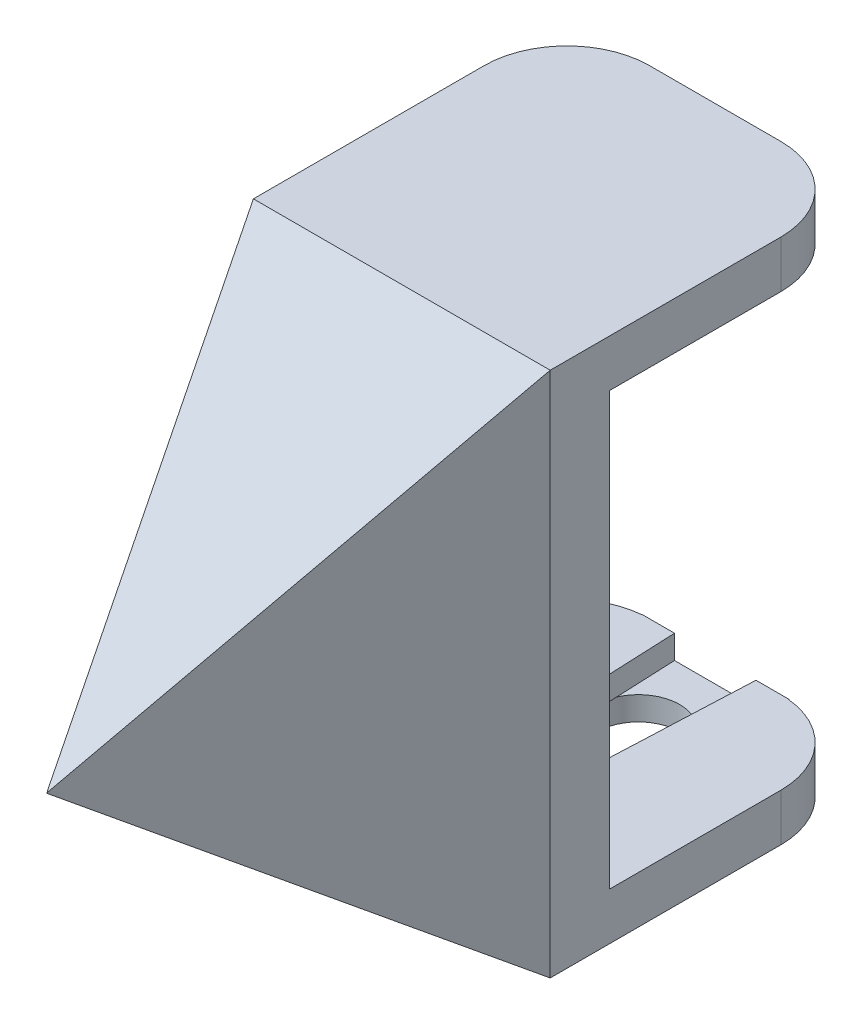
ISO-10303-21;
HEADER;
FILE_DESCRIPTION(('STEP AP214'),'2;1');
FILE_NAME('part.step','',(''),(''),'','','');
FILE_SCHEMA(('AUTOMOTIVE_DESIGN { 1 0 10303 214 1 1 1 1 }'));
ENDSEC;
DATA;
#1=APPLICATION_CONTEXT('core data for automotive mechanical design processes');
#2=APPLICATION_PROTOCOL_DEFINITION('international standard','automotive_design',2000,#1);
#3=PRODUCT_CONTEXT('',#1,'mechanical');
#4=PRODUCT('Part','Part','',(#3));
#5=PRODUCT_RELATED_PRODUCT_CATEGORY('part','',(#4));
#6=PRODUCT_DEFINITION_FORMATION('','',#4);
#7=PRODUCT_DEFINITION_CONTEXT('part definition',#1,'design');
#8=PRODUCT_DEFINITION('design','',#6,#7);
#9=PRODUCT_DEFINITION_SHAPE('','',#8);
#10=(LENGTH_UNIT() NAMED_UNIT(*) SI_UNIT(.MILLI.,.METRE.));
#11=(NAMED_UNIT(*) PLANE_ANGLE_UNIT() SI_UNIT($,.RADIAN.));
#12=(NAMED_UNIT(*) SI_UNIT($,.STERADIAN.) SOLID_ANGLE_UNIT());
#13=UNCERTAINTY_MEASURE_WITH_UNIT(LENGTH_MEASURE(1.E-05),#10,'distance_accuracy_value','');
#14=(GEOMETRIC_REPRESENTATION_CONTEXT(3) GLOBAL_UNCERTAINTY_ASSIGNED_CONTEXT((#13)) GLOBAL_UNIT_ASSIGNED_CONTEXT((#10,
#11,#12)) REPRESENTATION_CONTEXT('',''));
#15=CARTESIAN_POINT('',(0.,0.,0.));
#16=DIRECTION('',(0.,0.,1.));
#17=DIRECTION('',(1.,0.,0.));
#18=AXIS2_PLACEMENT_3D('',#15,#16,#17);
#19=CARTESIAN_POINT('',(64.3396378324059,18.25,-5.));
#20=DIRECTION('',(0.,0.,1.));
#21=DIRECTION('',(0.,-1.,0.));
#22=AXIS2_PLACEMENT_3D('',#19,#20,#21);
#23=PLANE('',#22);
#24=DIRECTION('',(0.,-1.,0.));
#25=VECTOR('',#24,1.);
#26=CARTESIAN_POINT('',(-2.5,3.56930453656055,-5.00000000000001));
#27=LINE('',#26,#25);
#28=CARTESIAN_POINT('',(-2.5,-18.25,-5.00000000000001));
#29=VERTEX_POINT('',#28);
#30=CARTESIAN_POINT('',(-2.5,-20.25,-5.));
#31=VERTEX_POINT('',#30);
#32=EDGE_CURVE('E255',#29,#31,#27,.T.);
#33=ORIENTED_EDGE('',*,*,#32,.F.);
#34=DIRECTION('',(-1.,0.,0.));
#35=VECTOR('',#34,1.);
#36=CARTESIAN_POINT('',(64.3396378324059,-18.25,-5.00000000000001));
#37=LINE('',#36,#35);
#38=CARTESIAN_POINT('',(-10.2911800707043,-18.25,-4.99999999999999));
#39=VERTEX_POINT('',#38);
#40=EDGE_CURVE('E57',#29,#39,#37,.T.);
#41=ORIENTED_EDGE('',*,*,#40,.T.);
#42=DIRECTION('',(0.491187513523803,0.871053859734462,0.));
#43=VECTOR('',#42,1.);
#44=CARTESIAN_POINT('',(23.3311906068374,41.3746747845644,-5.));
#45=LINE('',#44,#43);
#46=CARTESIAN_POINT('',(0.,0.,-5.));
#47=VERTEX_POINT('',#46);
#48=EDGE_CURVE('E307',#39,#47,#45,.T.);
#49=ORIENTED_EDGE('',*,*,#48,.T.);
#50=DIRECTION('',(-0.566525946334175,0.824043901822086,0.));
#51=VECTOR('',#50,1.);
#52=CARTESIAN_POINT('',(12.1300416994218,-17.6438289471741,-5.00000000000001));
#53=LINE('',#52,#51);
#54=CARTESIAN_POINT('',(-12.5467811820916,18.25,-5.));
#55=VERTEX_POINT('',#54);
#56=EDGE_CURVE('E314',#47,#55,#53,.T.);
#57=ORIENTED_EDGE('',*,*,#56,.T.);
#58=DIRECTION('',(-1.,0.,0.));
#59=VECTOR('',#58,1.);
#60=CARTESIAN_POINT('',(64.3396378324059,18.25,-5.));
#61=LINE('',#60,#59);
#62=CARTESIAN_POINT('',(12.5467811820916,18.25,-5.));
#63=VERTEX_POINT('',#62);
#64=EDGE_CURVE('E355',#63,#55,#61,.T.);
#65=ORIENTED_EDGE('',*,*,#64,.F.);
#66=DIRECTION('',(0.,1.,0.));
#67=VECTOR('',#66,1.);
#68=CARTESIAN_POINT('',(12.5467811820916,18.25,-5.));
#69=LINE('',#68,#67);
#70=CARTESIAN_POINT('',(12.5467811820916,-18.25,-5.00000000000001));
#71=VERTEX_POINT('',#70);
#72=EDGE_CURVE('E364',#71,#63,#69,.T.);
#73=ORIENTED_EDGE('',*,*,#72,.F.);
#74=CARTESIAN_POINT('',(2.5,-18.25,-5.00000000000001));
#75=VERTEX_POINT('',#74);
#76=EDGE_CURVE('E61',#71,#75,#37,.T.);
#77=ORIENTED_EDGE('',*,*,#76,.T.);
#78=DIRECTION('',(0.,-1.,0.));
#79=VECTOR('',#78,1.);
#80=CARTESIAN_POINT('',(2.5,3.56930453656055,-5.));
#81=LINE('',#80,#79);
#82=CARTESIAN_POINT('',(2.5,-20.25,-4.99999999999999));
#83=VERTEX_POINT('',#82);
#84=EDGE_CURVE('E270',#75,#83,#81,.T.);
#85=ORIENTED_EDGE('',*,*,#84,.T.);
#86=DIRECTION('',(1.,0.,0.));
#87=VECTOR('',#86,1.);
#88=CARTESIAN_POINT('',(6.21914646917428,-20.25,-5.));
#89=LINE('',#88,#87);
#90=EDGE_CURVE('E332',#31,#83,#89,.T.);
#91=ORIENTED_EDGE('',*,*,#90,.F.);
#92=EDGE_LOOP('',(#33,#41,#49,#57,#65,#73,#77,#85,#91));
#93=FACE_BOUND('',#92,.T.);
#94=ADVANCED_FACE('F41',(#93),#23,.F.);
#95=CARTESIAN_POINT('',(0.,-20.25,0.));
#96=DIRECTION('',(0.,1.,0.));
#97=DIRECTION('',(0.,0.,1.));
#98=AXIS2_PLACEMENT_3D('',#95,#96,#97);
#99=PLANE('',#98);
#100=CARTESIAN_POINT('',(0.,-20.25,-10.));
#101=DIRECTION('',(0.,1.,0.));
#102=DIRECTION('',(0.,0.,1.));
#103=AXIS2_PLACEMENT_3D('',#100,#101,#102);
#104=CIRCLE('',#103,0.750000000000002);
#105=CARTESIAN_POINT('',(0.,-20.25,-9.25000000000001));
#106=VERTEX_POINT('',#105);
#107=EDGE_CURVE('E624',#106,#106,#104,.F.);
#108=ORIENTED_EDGE('',*,*,#107,.T.);
#109=EDGE_LOOP('',(#108));
#110=FACE_BOUND('',#109,.T.);
#111=DIRECTION('',(-0.0438577587864707,0.,-0.999037785568808));
#112=VECTOR('',#111,1.);
#113=CARTESIAN_POINT('',(-3.1585,-20.25,-20.));
#114=LINE('',#113,#112);
#115=CARTESIAN_POINT('',(-3.08601135668406,-20.25,-18.3487780565845));
#116=VERTEX_POINT('',#115);
#117=EDGE_CURVE('E224',#31,#116,#114,.T.);
#118=ORIENTED_EDGE('',*,*,#117,.F.);
#119=ORIENTED_EDGE('',*,*,#90,.T.);
#120=DIRECTION('',(-0.0438577587864707,0.,0.999037785568808));
#121=VECTOR('',#120,1.);
#122=CARTESIAN_POINT('',(3.1585,-20.25,-20.));
#123=LINE('',#122,#121);
#124=CARTESIAN_POINT('',(3.08601135668406,-20.25,-18.3487780565845));
#125=VERTEX_POINT('',#124);
#126=EDGE_CURVE('E272',#125,#83,#123,.T.);
#127=ORIENTED_EDGE('',*,*,#126,.F.);
#128=CARTESIAN_POINT('',(0.,-20.25,-20.));
#129=DIRECTION('',(0.,1.,0.));
#130=DIRECTION('',(0.,0.,1.));
#131=AXIS2_PLACEMENT_3D('',#128,#129,#130);
#132=CIRCLE('',#131,3.5);
#133=EDGE_CURVE('E330',#116,#125,#132,.T.);
#134=ORIENTED_EDGE('',*,*,#133,.F.);
#135=EDGE_LOOP('',(#118,#119,#127,#134));
#136=FACE_BOUND('',#135,.T.);
#137=ADVANCED_FACE('F447',(#110,#136),#99,.T.);
#138=CARTESIAN_POINT('',(64.3396378324059,-22.25,-26.5));
#139=DIRECTION('',(0.,1.,0.));
#140=DIRECTION('',(0.,0.,1.));
#141=AXIS2_PLACEMENT_3D('',#138,#139,#140);
#142=PLANE('',#141);
#143=CARTESIAN_POINT('',(0.,-22.25,-10.));
#144=DIRECTION('',(0.,-1.,0.));
#145=DIRECTION('',(0.,0.,-1.));
#146=AXIS2_PLACEMENT_3D('',#143,#144,#145);
#147=CIRCLE('',#146,0.750000000000002);
#148=CARTESIAN_POINT('',(0.,-22.25,-10.75));
#149=VERTEX_POINT('',#148);
#150=EDGE_CURVE('E282',#149,#149,#147,.T.);
#151=ORIENTED_EDGE('',*,*,#150,.F.);
#152=EDGE_LOOP('',(#151));
#153=FACE_BOUND('',#152,.T.);
#154=CARTESIAN_POINT('',(0.,-22.25,-20.));
#155=DIRECTION('',(0.,1.,0.));
#156=DIRECTION('',(0.,0.,1.));
#157=AXIS2_PLACEMENT_3D('',#154,#155,#156);
#158=CIRCLE('',#157,3.5);
#159=CARTESIAN_POINT('',(0.,-22.25,-16.5));
#160=VERTEX_POINT('',#159);
#161=EDGE_CURVE('E328',#160,#160,#158,.T.);
#162=ORIENTED_EDGE('',*,*,#161,.T.);
#163=EDGE_LOOP('',(#162));
#164=FACE_BOUND('',#163,.T.);
#165=DIRECTION('',(1.,0.,0.));
#166=VECTOR('',#165,1.);
#167=CARTESIAN_POINT('',(-12.5467811820916,-22.25,0.));
#168=LINE('',#167,#166);
#169=CARTESIAN_POINT('',(-12.5467811820916,-22.25,0.));
#170=VERTEX_POINT('',#169);
#171=CARTESIAN_POINT('',(12.5467811820916,-22.25,0.));
#172=VERTEX_POINT('',#171);
#173=EDGE_CURVE('E318',#170,#172,#168,.T.);
#174=ORIENTED_EDGE('',*,*,#173,.F.);
#175=DIRECTION('',(0.,0.,-1.));
#176=VECTOR('',#175,1.);
#177=CARTESIAN_POINT('',(-12.5467811820916,-22.25,-26.5));
#178=LINE('',#177,#176);
#179=CARTESIAN_POINT('',(-12.5467811820916,-22.25,-19.5));
#180=VERTEX_POINT('',#179);
#181=EDGE_CURVE('E340',#170,#180,#178,.T.);
#182=ORIENTED_EDGE('',*,*,#181,.T.);
#183=CARTESIAN_POINT('',(-5.54678118209162,-22.25,-19.5));
#184=DIRECTION('',(0.,1.,0.));
#185=DIRECTION('',(0.,0.,1.));
#186=AXIS2_PLACEMENT_3D('',#183,#184,#185);
#187=CIRCLE('',#186,7.);
#188=CARTESIAN_POINT('',(-5.54678118209162,-22.25,-26.5));
#189=VERTEX_POINT('',#188);
#190=EDGE_CURVE('E398',#180,#189,#187,.F.);
#191=ORIENTED_EDGE('',*,*,#190,.T.);
#192=DIRECTION('',(-1.,0.,0.));
#193=VECTOR('',#192,1.);
#194=CARTESIAN_POINT('',(64.3396378324059,-22.25,-26.5));
#195=LINE('',#194,#193);
#196=CARTESIAN_POINT('',(5.54678118209161,-22.25,-26.5));
#197=VERTEX_POINT('',#196);
#198=EDGE_CURVE('E338',#197,#189,#195,.T.);
#199=ORIENTED_EDGE('',*,*,#198,.F.);
#200=CARTESIAN_POINT('',(5.54678118209161,-22.25,-19.5));
#201=DIRECTION('',(0.,1.,0.));
#202=DIRECTION('',(0.,0.,1.));
#203=AXIS2_PLACEMENT_3D('',#200,#201,#202);
#204=CIRCLE('',#203,7.);
#205=CARTESIAN_POINT('',(12.5467811820916,-22.25,-19.5));
#206=VERTEX_POINT('',#205);
#207=EDGE_CURVE('E395',#197,#206,#204,.F.);
#208=ORIENTED_EDGE('',*,*,#207,.T.);
#209=DIRECTION('',(0.,0.,-1.));
#210=VECTOR('',#209,1.);
#211=CARTESIAN_POINT('',(12.5467811820916,-22.25,-26.5));
#212=LINE('',#211,#210);
#213=EDGE_CURVE('E337',#172,#206,#212,.T.);
#214=ORIENTED_EDGE('',*,*,#213,.F.);
#215=EDGE_LOOP('',(#174,#182,#191,#199,#208,#214));
#216=FACE_BOUND('',#215,.T.);
#217=ADVANCED_FACE('F451',(#153,#164,#216),#142,.F.);
#218=CARTESIAN_POINT('',(-12.5467811820916,-53.9370800671778,23.55));
#219=DIRECTION('',(-1.,0.,0.));
#220=DIRECTION('',(0.,0.,1.));
#221=AXIS2_PLACEMENT_3D('',#218,#219,#220);
#222=PLANE('',#221);
#223=DIRECTION('',(0.,0.,-1.));
#224=VECTOR('',#223,1.);
#225=CARTESIAN_POINT('',(-12.5467811820916,18.25,30.));
#226=LINE('',#225,#224);
#227=CARTESIAN_POINT('',(-12.5467811820916,18.25,0.));
#228=VERTEX_POINT('',#227);
#229=EDGE_CURVE('E291',#228,#55,#226,.T.);
#230=ORIENTED_EDGE('',*,*,#229,.F.);
#231=DIRECTION('',(0.,-1.,0.));
#232=VECTOR('',#231,1.);
#233=CARTESIAN_POINT('',(-12.5467811820916,-22.25,0.));
#234=LINE('',#233,#232);
#235=CARTESIAN_POINT('',(-12.5467811820916,22.25,0.));
#236=VERTEX_POINT('',#235);
#237=EDGE_CURVE('E341',#236,#228,#234,.T.);
#238=ORIENTED_EDGE('',*,*,#237,.F.);
#239=DIRECTION('',(0.,0.,1.));
#240=VECTOR('',#239,1.);
#241=CARTESIAN_POINT('',(-12.5467811820916,22.25,0.));
#242=LINE('',#241,#240);
#243=CARTESIAN_POINT('',(-12.5467811820916,22.25,-19.5));
#244=VERTEX_POINT('',#243);
#245=EDGE_CURVE('E342',#244,#236,#242,.T.);
#246=ORIENTED_EDGE('',*,*,#245,.F.);
#247=DIRECTION('',(0.,1.,0.));
#248=VECTOR('',#247,1.);
#249=CARTESIAN_POINT('',(-12.5467811820916,18.25,-19.5));
#250=LINE('',#249,#248);
#251=CARTESIAN_POINT('',(-12.5467811820916,18.25,-19.5));
#252=VERTEX_POINT('',#251);
#253=EDGE_CURVE('E394',#244,#252,#250,.F.);
#254=ORIENTED_EDGE('',*,*,#253,.T.);
#255=DIRECTION('',(0.,0.,-1.));
#256=VECTOR('',#255,1.);
#257=CARTESIAN_POINT('',(-12.5467811820916,18.25,-26.5));
#258=LINE('',#257,#256);
#259=EDGE_CURVE('E348',#55,#252,#258,.T.);
#260=ORIENTED_EDGE('',*,*,#259,.F.);
#261=EDGE_LOOP('',(#230,#238,#246,#254,#260));
#262=FACE_BOUND('',#261,.T.);
#263=ADVANCED_FACE('F468',(#262),#222,.T.);
#264=CARTESIAN_POINT('',(64.3396378324059,-18.25,-5.00000000000001));
#265=DIRECTION('',(0.,-1.,0.));
#266=DIRECTION('',(0.,0.,-1.));
#267=AXIS2_PLACEMENT_3D('',#264,#265,#266);
#268=PLANE('',#267);
#269=CARTESIAN_POINT('',(-5.54678118209162,-18.25,-19.5));
#270=DIRECTION('',(0.,-1.,0.));
#271=DIRECTION('',(0.,0.,-1.));
#272=AXIS2_PLACEMENT_3D('',#269,#270,#271);
#273=CIRCLE('',#272,7.);
#274=CARTESIAN_POINT('',(-6.21914646917426,-18.25,-26.4676340977929));
#275=VERTEX_POINT('',#274);
#276=CARTESIAN_POINT('',(-10.2911800707044,-18.25,-24.6469096733603));
#277=VERTEX_POINT('',#276);
#278=EDGE_CURVE('E386',#275,#277,#273,.F.);
#279=ORIENTED_EDGE('',*,*,#278,.T.);
#280=DIRECTION('',(0.,0.,1.));
#281=VECTOR('',#280,1.);
#282=CARTESIAN_POINT('',(-10.2911800707043,-18.25,-5.00000000000001));
#283=LINE('',#282,#281);
#284=EDGE_CURVE('E305',#277,#39,#283,.T.);
#285=ORIENTED_EDGE('',*,*,#284,.T.);
#286=ORIENTED_EDGE('',*,*,#40,.F.);
#287=DIRECTION('',(0.0438577587864707,0.,0.999037785568808));
#288=VECTOR('',#287,1.);
#289=CARTESIAN_POINT('',(-3.1585,-18.25,-20.));
#290=LINE('',#289,#288);
#291=CARTESIAN_POINT('',(-3.44385,-18.25,-26.5));
#292=VERTEX_POINT('',#291);
#293=EDGE_CURVE('E260',#292,#29,#290,.T.);
#294=ORIENTED_EDGE('',*,*,#293,.F.);
#295=DIRECTION('',(1.,0.,0.));
#296=VECTOR('',#295,1.);
#297=CARTESIAN_POINT('',(-3.44385,-18.25,-26.5));
#298=LINE('',#297,#296);
#299=CARTESIAN_POINT('',(-6.21914646917426,-18.25,-26.5));
#300=VERTEX_POINT('',#299);
#301=EDGE_CURVE('E257',#300,#292,#298,.T.);
#302=ORIENTED_EDGE('',*,*,#301,.F.);
#303=DIRECTION('',(0.,0.,-1.));
#304=VECTOR('',#303,1.);
#305=CARTESIAN_POINT('',(-6.21914646917426,-18.25,-26.5));
#306=LINE('',#305,#304);
#307=EDGE_CURVE('E231',#275,#300,#306,.T.);
#308=ORIENTED_EDGE('',*,*,#307,.F.);
#309=EDGE_LOOP('',(#279,#285,#286,#294,#302,#308));
#310=FACE_BOUND('',#309,.T.);
#311=ADVANCED_FACE('F464',(#310),#268,.F.);
#312=DIRECTION('',(0.,0.,1.));
#313=VECTOR('',#312,1.);
#314=CARTESIAN_POINT('',(12.5467811820916,-18.25,-5.00000000000001));
#315=LINE('',#314,#313);
#316=CARTESIAN_POINT('',(12.5467811820916,-18.25,-19.5));
#317=VERTEX_POINT('',#316);
#318=EDGE_CURVE('E368',#317,#71,#315,.T.);
#319=ORIENTED_EDGE('',*,*,#318,.F.);
#320=CARTESIAN_POINT('',(5.54678118209161,-18.25,-19.5));
#321=DIRECTION('',(0.,-1.,0.));
#322=DIRECTION('',(0.,0.,-1.));
#323=AXIS2_PLACEMENT_3D('',#320,#321,#322);
#324=CIRCLE('',#323,7.);
#325=CARTESIAN_POINT('',(6.21914646917426,-18.25,-26.4676340977929));
#326=VERTEX_POINT('',#325);
#327=EDGE_CURVE('E405',#317,#326,#324,.F.);
#328=ORIENTED_EDGE('',*,*,#327,.T.);
#329=DIRECTION('',(0.,0.,1.));
#330=VECTOR('',#329,1.);
#331=CARTESIAN_POINT('',(6.21914646917428,-18.25,-5.));
#332=LINE('',#331,#330);
#333=CARTESIAN_POINT('',(6.21914646917428,-18.25,-26.5));
#334=VERTEX_POINT('',#333);
#335=EDGE_CURVE('E259',#334,#326,#332,.T.);
#336=ORIENTED_EDGE('',*,*,#335,.F.);
#337=DIRECTION('',(1.,0.,0.));
#338=VECTOR('',#337,1.);
#339=CARTESIAN_POINT('',(3.44385,-18.25,-26.5));
#340=LINE('',#339,#338);
#341=CARTESIAN_POINT('',(3.44385,-18.25,-26.5));
#342=VERTEX_POINT('',#341);
#343=EDGE_CURVE('E277',#342,#334,#340,.T.);
#344=ORIENTED_EDGE('',*,*,#343,.F.);
#345=DIRECTION('',(0.0438577587864707,0.,-0.999037785568808));
#346=VECTOR('',#345,1.);
#347=CARTESIAN_POINT('',(3.1585,-18.25,-20.));
#348=LINE('',#347,#346);
#349=EDGE_CURVE('E264',#75,#342,#348,.T.);
#350=ORIENTED_EDGE('',*,*,#349,.F.);
#351=ORIENTED_EDGE('',*,*,#76,.F.);
#352=EDGE_LOOP('',(#319,#328,#336,#344,#350,#351));
#353=FACE_BOUND('',#352,.T.);
#354=ADVANCED_FACE('F463',(#353),#268,.F.);
#355=CARTESIAN_POINT('',(12.5467811820916,-53.9370800671778,23.55));
#356=DIRECTION('',(1.,0.,0.));
#357=DIRECTION('',(0.,0.,-1.));
#358=AXIS2_PLACEMENT_3D('',#355,#356,#357);
#359=PLANE('',#358);
#360=DIRECTION('',(0.,-1.,0.));
#361=VECTOR('',#360,1.);
#362=CARTESIAN_POINT('',(12.5467811820916,-22.25,0.));
#363=LINE('',#362,#361);
#364=CARTESIAN_POINT('',(12.5467811820916,22.25,0.));
#365=VERTEX_POINT('',#364);
#366=EDGE_CURVE('E352',#365,#172,#363,.T.);
#367=ORIENTED_EDGE('',*,*,#366,.T.);
#368=ORIENTED_EDGE('',*,*,#213,.T.);
#369=DIRECTION('',(0.,1.,0.));
#370=VECTOR('',#369,1.);
#371=CARTESIAN_POINT('',(12.5467811820916,-18.25,-19.5));
#372=LINE('',#371,#370);
#373=EDGE_CURVE('E403',#206,#317,#372,.T.);
#374=ORIENTED_EDGE('',*,*,#373,.T.);
#375=ORIENTED_EDGE('',*,*,#318,.T.);
#376=ORIENTED_EDGE('',*,*,#72,.T.);
#377=DIRECTION('',(0.,0.,-1.));
#378=VECTOR('',#377,1.);
#379=CARTESIAN_POINT('',(12.5467811820916,18.25,-26.5));
#380=LINE('',#379,#378);
#381=CARTESIAN_POINT('',(12.5467811820916,18.25,-19.5));
#382=VERTEX_POINT('',#381);
#383=EDGE_CURVE('E358',#63,#382,#380,.T.);
#384=ORIENTED_EDGE('',*,*,#383,.T.);
#385=DIRECTION('',(0.,1.,0.));
#386=VECTOR('',#385,1.);
#387=CARTESIAN_POINT('',(12.5467811820916,22.25,-19.5));
#388=LINE('',#387,#386);
#389=CARTESIAN_POINT('',(12.5467811820916,22.25,-19.5));
#390=VERTEX_POINT('',#389);
#391=EDGE_CURVE('E396',#382,#390,#388,.T.);
#392=ORIENTED_EDGE('',*,*,#391,.T.);
#393=DIRECTION('',(0.,0.,1.));
#394=VECTOR('',#393,1.);
#395=CARTESIAN_POINT('',(12.5467811820916,22.25,0.));
#396=LINE('',#395,#394);
#397=EDGE_CURVE('E360',#390,#365,#396,.T.);
#398=ORIENTED_EDGE('',*,*,#397,.T.);
#399=EDGE_LOOP('',(#367,#368,#374,#375,#376,#384,#392,#398));
#400=FACE_BOUND('',#399,.T.);
#401=ADVANCED_FACE('F470',(#400),#359,.T.);
#402=CARTESIAN_POINT('',(64.3396378324059,-18.25,-26.5));
#403=DIRECTION('',(0.,0.,1.));
#404=DIRECTION('',(0.,-1.,0.));
#405=AXIS2_PLACEMENT_3D('',#402,#403,#404);
#406=PLANE('',#405);
#407=ORIENTED_EDGE('',*,*,#198,.T.);
#408=DIRECTION('',(0.,1.,0.));
#409=VECTOR('',#408,1.);
#410=CARTESIAN_POINT('',(-5.54678118209162,-18.25,-26.5));
#411=LINE('',#410,#409);
#412=CARTESIAN_POINT('',(-5.54678118209162,-20.25,-26.5));
#413=VERTEX_POINT('',#412);
#414=EDGE_CURVE('E223',#189,#413,#411,.T.);
#415=ORIENTED_EDGE('',*,*,#414,.T.);
#416=DIRECTION('',(-1.,0.,0.));
#417=VECTOR('',#416,1.);
#418=CARTESIAN_POINT('',(-3.44385,-20.25,-26.5));
#419=LINE('',#418,#417);
#420=CARTESIAN_POINT('',(-6.21914646917426,-20.25,-26.5));
#421=VERTEX_POINT('',#420);
#422=EDGE_CURVE('E211',#413,#421,#419,.T.);
#423=ORIENTED_EDGE('',*,*,#422,.T.);
#424=DIRECTION('',(0.,-1.,0.));
#425=VECTOR('',#424,1.);
#426=CARTESIAN_POINT('',(-6.21914646917426,3.56930453656056,-26.5));
#427=LINE('',#426,#425);
#428=EDGE_CURVE('E220',#300,#421,#427,.T.);
#429=ORIENTED_EDGE('',*,*,#428,.F.);
#430=ORIENTED_EDGE('',*,*,#301,.T.);
#431=DIRECTION('',(0.,-1.,0.));
#432=VECTOR('',#431,1.);
#433=CARTESIAN_POINT('',(-3.44385,3.56930453656056,-26.5));
#434=LINE('',#433,#432);
#435=CARTESIAN_POINT('',(-3.44385,-20.25,-26.5));
#436=VERTEX_POINT('',#435);
#437=EDGE_CURVE('E233',#292,#436,#434,.T.);
#438=ORIENTED_EDGE('',*,*,#437,.T.);
#439=DIRECTION('',(-1.,0.,0.));
#440=VECTOR('',#439,1.);
#441=CARTESIAN_POINT('',(6.21914646917426,-20.25,-26.5));
#442=LINE('',#441,#440);
#443=CARTESIAN_POINT('',(3.44385,-20.25,-26.5));
#444=VERTEX_POINT('',#443);
#445=EDGE_CURVE('E326',#444,#436,#442,.T.);
#446=ORIENTED_EDGE('',*,*,#445,.F.);
#447=DIRECTION('',(0.,-1.,0.));
#448=VECTOR('',#447,1.);
#449=CARTESIAN_POINT('',(3.44385,3.56930453656056,-26.5));
#450=LINE('',#449,#448);
#451=EDGE_CURVE('E261',#342,#444,#450,.T.);
#452=ORIENTED_EDGE('',*,*,#451,.F.);
#453=ORIENTED_EDGE('',*,*,#343,.T.);
#454=DIRECTION('',(0.,-1.,0.));
#455=VECTOR('',#454,1.);
#456=CARTESIAN_POINT('',(6.21914646917428,3.56930453656056,-26.5));
#457=LINE('',#456,#455);
#458=CARTESIAN_POINT('',(6.21914646917428,-20.25,-26.5));
#459=VERTEX_POINT('',#458);
#460=EDGE_CURVE('E267',#334,#459,#457,.T.);
#461=ORIENTED_EDGE('',*,*,#460,.T.);
#462=DIRECTION('',(-1.,0.,0.));
#463=VECTOR('',#462,1.);
#464=CARTESIAN_POINT('',(3.44385,-20.25,-26.5));
#465=LINE('',#464,#463);
#466=CARTESIAN_POINT('',(5.54678118209161,-20.25,-26.5));
#467=VERTEX_POINT('',#466);
#468=EDGE_CURVE('E238',#459,#467,#465,.T.);
#469=ORIENTED_EDGE('',*,*,#468,.T.);
#470=DIRECTION('',(0.,1.,0.));
#471=VECTOR('',#470,1.);
#472=CARTESIAN_POINT('',(5.54678118209161,-22.25,-26.5));
#473=LINE('',#472,#471);
#474=EDGE_CURVE('E357',#467,#197,#473,.F.);
#475=ORIENTED_EDGE('',*,*,#474,.T.);
#476=EDGE_LOOP('',(#407,#415,#423,#429,#430,#438,#446,#452,#453,#461,#469,#475));
#477=FACE_BOUND('',#476,.T.);
#478=ADVANCED_FACE('F219',(#477),#406,.F.);
#479=CARTESIAN_POINT('',(64.3396378324059,18.25,-26.5));
#480=DIRECTION('',(0.,1.,0.));
#481=DIRECTION('',(0.,0.,1.));
#482=AXIS2_PLACEMENT_3D('',#479,#480,#481);
#483=PLANE('',#482);
#484=DIRECTION('',(-1.,0.,0.));
#485=VECTOR('',#484,1.);
#486=CARTESIAN_POINT('',(64.3396378324059,18.25,-26.5));
#487=LINE('',#486,#485);
#488=CARTESIAN_POINT('',(0.,18.25,-26.5));
#489=VERTEX_POINT('',#488);
#490=CARTESIAN_POINT('',(-5.54678118209162,18.25,-26.5));
#491=VERTEX_POINT('',#490);
#492=EDGE_CURVE('E351',#489,#491,#487,.T.);
#493=ORIENTED_EDGE('',*,*,#492,.F.);
#494=CARTESIAN_POINT('',(0.,18.25,-20.));
#495=DIRECTION('',(0.,1.,0.));
#496=DIRECTION('',(0.,0.,1.));
#497=AXIS2_PLACEMENT_3D('',#494,#495,#496);
#498=CIRCLE('',#497,6.5);
#499=EDGE_CURVE('E293',#489,#489,#498,.T.);
#500=ORIENTED_EDGE('',*,*,#499,.T.);
#501=CARTESIAN_POINT('',(5.54678118209161,18.25,-26.5));
#502=VERTEX_POINT('',#501);
#503=EDGE_CURVE('E371',#502,#489,#487,.T.);
#504=ORIENTED_EDGE('',*,*,#503,.F.);
#505=CARTESIAN_POINT('',(5.54678118209161,18.25,-19.5));
#506=DIRECTION('',(0.,1.,0.));
#507=DIRECTION('',(0.,0.,1.));
#508=AXIS2_PLACEMENT_3D('',#505,#506,#507);
#509=CIRCLE('',#508,7.);
#510=EDGE_CURVE('E418',#502,#382,#509,.F.);
#511=ORIENTED_EDGE('',*,*,#510,.T.);
#512=ORIENTED_EDGE('',*,*,#383,.F.);
#513=ORIENTED_EDGE('',*,*,#64,.T.);
#514=ORIENTED_EDGE('',*,*,#259,.T.);
#515=CARTESIAN_POINT('',(-5.54678118209162,18.25,-19.5));
#516=DIRECTION('',(0.,1.,0.));
#517=DIRECTION('',(0.,0.,1.));
#518=AXIS2_PLACEMENT_3D('',#515,#516,#517);
#519=CIRCLE('',#518,7.);
#520=EDGE_CURVE('E419',#252,#491,#519,.F.);
#521=ORIENTED_EDGE('',*,*,#520,.T.);
#522=EDGE_LOOP('',(#493,#500,#504,#511,#512,#513,#514,#521));
#523=FACE_BOUND('',#522,.T.);
#524=ADVANCED_FACE('F462',(#523),#483,.F.);
#525=CARTESIAN_POINT('',(64.3396378324059,22.25,-26.5));
#526=DIRECTION('',(0.,0.,1.));
#527=DIRECTION('',(0.,-1.,0.));
#528=AXIS2_PLACEMENT_3D('',#525,#526,#527);
#529=PLANE('',#528);
#530=ORIENTED_EDGE('',*,*,#503,.T.);
#531=ORIENTED_EDGE('',*,*,#492,.T.);
#532=DIRECTION('',(0.,1.,0.));
#533=VECTOR('',#532,1.);
#534=CARTESIAN_POINT('',(-5.54678118209162,22.25,-26.5));
#535=LINE('',#534,#533);
#536=CARTESIAN_POINT('',(-5.54678118209162,22.25,-26.5));
#537=VERTEX_POINT('',#536);
#538=EDGE_CURVE('E413',#491,#537,#535,.T.);
#539=ORIENTED_EDGE('',*,*,#538,.T.);
#540=DIRECTION('',(-1.,0.,0.));
#541=VECTOR('',#540,1.);
#542=CARTESIAN_POINT('',(64.3396378324059,22.25,-26.5));
#543=LINE('',#542,#541);
#544=CARTESIAN_POINT('',(5.54678118209161,22.25,-26.5));
#545=VERTEX_POINT('',#544);
#546=EDGE_CURVE('E350',#545,#537,#543,.T.);
#547=ORIENTED_EDGE('',*,*,#546,.F.);
#548=DIRECTION('',(0.,1.,0.));
#549=VECTOR('',#548,1.);
#550=CARTESIAN_POINT('',(5.54678118209161,18.25,-26.5));
#551=LINE('',#550,#549);
#552=EDGE_CURVE('E410',#545,#502,#551,.F.);
#553=ORIENTED_EDGE('',*,*,#552,.T.);
#554=EDGE_LOOP('',(#530,#531,#539,#547,#553));
#555=FACE_BOUND('',#554,.T.);
#556=ADVANCED_FACE('F579',(#555),#529,.F.);
#557=CARTESIAN_POINT('',(64.3396378324059,22.25,0.));
#558=DIRECTION('',(0.,-1.,0.));
#559=DIRECTION('',(0.,0.,-1.));
#560=AXIS2_PLACEMENT_3D('',#557,#558,#559);
#561=PLANE('',#560);
#562=ORIENTED_EDGE('',*,*,#546,.T.);
#563=CARTESIAN_POINT('',(-5.54678118209162,22.25,-19.5));
#564=DIRECTION('',(0.,-1.,0.));
#565=DIRECTION('',(0.,0.,-1.));
#566=AXIS2_PLACEMENT_3D('',#563,#564,#565);
#567=CIRCLE('',#566,7.);
#568=EDGE_CURVE('E416',#537,#244,#567,.F.);
#569=ORIENTED_EDGE('',*,*,#568,.T.);
#570=ORIENTED_EDGE('',*,*,#245,.T.);
#571=DIRECTION('',(1.,0.,0.));
#572=VECTOR('',#571,1.);
#573=CARTESIAN_POINT('',(-12.5467811820916,22.25,0.));
#574=LINE('',#573,#572);
#575=EDGE_CURVE('E317',#236,#365,#574,.T.);
#576=ORIENTED_EDGE('',*,*,#575,.T.);
#577=ORIENTED_EDGE('',*,*,#397,.F.);
#578=CARTESIAN_POINT('',(5.54678118209161,22.25,-19.5));
#579=DIRECTION('',(0.,-1.,0.));
#580=DIRECTION('',(0.,0.,-1.));
#581=AXIS2_PLACEMENT_3D('',#578,#579,#580);
#582=CIRCLE('',#581,7.);
#583=EDGE_CURVE('E414',#390,#545,#582,.F.);
#584=ORIENTED_EDGE('',*,*,#583,.T.);
#585=EDGE_LOOP('',(#562,#569,#570,#576,#577,#584));
#586=FACE_BOUND('',#585,.T.);
#587=ADVANCED_FACE('F544',(#586),#561,.F.);
#588=CARTESIAN_POINT('',(-3.21883787482848,-20.25,-21.3744390621522));
#589=VERTEX_POINT('',#588);
#590=EDGE_CURVE('E236',#589,#436,#114,.T.);
#591=ORIENTED_EDGE('',*,*,#590,.F.);
#592=CARTESIAN_POINT('',(3.21883787482848,-20.25,-21.3744390621521));
#593=VERTEX_POINT('',#592);
#594=EDGE_CURVE('E376',#593,#589,#132,.T.);
#595=ORIENTED_EDGE('',*,*,#594,.F.);
#596=EDGE_CURVE('E248',#444,#593,#123,.T.);
#597=ORIENTED_EDGE('',*,*,#596,.F.);
#598=ORIENTED_EDGE('',*,*,#445,.T.);
#599=EDGE_LOOP('',(#591,#595,#597,#598));
#600=FACE_BOUND('',#599,.T.);
#601=ADVANCED_FACE('F456',(#600),#99,.T.);
#602=CARTESIAN_POINT('',(0.,-22.25,-20.));
#603=DIRECTION('',(0.,1.,0.));
#604=DIRECTION('',(0.,0.,1.));
#605=AXIS2_PLACEMENT_3D('',#602,#603,#604);
#606=CYLINDRICAL_SURFACE('',#605,3.5);
#607=EDGE_CURVE('E331',#125,#593,#132,.T.);
#608=ORIENTED_EDGE('',*,*,#607,.T.);
#609=ORIENTED_EDGE('',*,*,#594,.T.);
#610=EDGE_CURVE('E294',#589,#116,#132,.T.);
#611=ORIENTED_EDGE('',*,*,#610,.T.);
#612=ORIENTED_EDGE('',*,*,#133,.T.);
#613=EDGE_LOOP('',(#608,#609,#611,#612));
#614=FACE_BOUND('',#613,.T.);
#615=ORIENTED_EDGE('',*,*,#161,.F.);
#616=EDGE_LOOP('',(#615));
#617=FACE_BOUND('',#616,.T.);
#618=ADVANCED_FACE('F476',(#614,#617),#606,.F.);
#619=CARTESIAN_POINT('',(-5.54678118209162,-18.25,-19.5));
#620=DIRECTION('',(0.,-1.,0.));
#621=DIRECTION('',(0.,0.,-1.));
#622=AXIS2_PLACEMENT_3D('',#619,#620,#621);
#623=CYLINDRICAL_SURFACE('',#622,7.);
#624=CARTESIAN_POINT('',(-5.54678118209162,-9.83645761493742,-19.5));
#625=DIRECTION('',(0.871053859734462,-0.491187513523803,0.));
#626=DIRECTION('',(-0.491187513523803,-0.871053859734462,0.));
#627=AXIS2_PLACEMENT_3D('',#624,#625,#626);
#628=ELLIPSE('',#627,14.2511766021527,7.);
#629=EDGE_CURVE('E304',#277,#180,#628,.F.);
#630=ORIENTED_EDGE('',*,*,#629,.F.);
#631=ORIENTED_EDGE('',*,*,#278,.F.);
#632=DIRECTION('',(0.,-1.,0.));
#633=VECTOR('',#632,1.);
#634=CARTESIAN_POINT('',(-6.21914646917427,-20.25,-26.4676340977929));
#635=LINE('',#634,#633);
#636=CARTESIAN_POINT('',(-6.21914646917427,-20.25,-26.4676340977929));
#637=VERTEX_POINT('',#636);
#638=EDGE_CURVE('E390',#637,#275,#635,.F.);
#639=ORIENTED_EDGE('',*,*,#638,.F.);
#640=CARTESIAN_POINT('',(-5.54678118209162,-20.25,-19.5));
#641=DIRECTION('',(0.,1.,0.));
#642=DIRECTION('',(0.,0.,1.));
#643=AXIS2_PLACEMENT_3D('',#640,#641,#642);
#644=CIRCLE('',#643,7.);
#645=EDGE_CURVE('E239',#413,#637,#644,.T.);
#646=ORIENTED_EDGE('',*,*,#645,.F.);
#647=ORIENTED_EDGE('',*,*,#414,.F.);
#648=ORIENTED_EDGE('',*,*,#190,.F.);
#649=EDGE_LOOP('',(#630,#631,#639,#646,#647,#648));
#650=FACE_BOUND('',#649,.T.);
#651=ADVANCED_FACE('F478',(#650),#623,.T.);
#652=CARTESIAN_POINT('',(5.54678118209161,-53.9370800671779,-19.4999999999999));
#653=DIRECTION('',(0.,-1.,0.));
#654=DIRECTION('',(0.,0.,-1.));
#655=AXIS2_PLACEMENT_3D('',#652,#653,#654);
#656=CYLINDRICAL_SURFACE('',#655,7.);
#657=ORIENTED_EDGE('',*,*,#207,.F.);
#658=ORIENTED_EDGE('',*,*,#474,.F.);
#659=CARTESIAN_POINT('',(5.54678118209161,-20.25,-19.5));
#660=DIRECTION('',(0.,1.,0.));
#661=DIRECTION('',(0.,0.,1.));
#662=AXIS2_PLACEMENT_3D('',#659,#660,#661);
#663=CIRCLE('',#662,7.);
#664=CARTESIAN_POINT('',(6.21914646917428,-20.25,-26.4676340977929));
#665=VERTEX_POINT('',#664);
#666=EDGE_CURVE('E381',#665,#467,#663,.T.);
#667=ORIENTED_EDGE('',*,*,#666,.F.);
#668=DIRECTION('',(0.,-1.,0.));
#669=VECTOR('',#668,1.);
#670=CARTESIAN_POINT('',(6.21914646917426,-18.25,-26.4676340977929));
#671=LINE('',#670,#669);
#672=EDGE_CURVE('E408',#326,#665,#671,.T.);
#673=ORIENTED_EDGE('',*,*,#672,.F.);
#674=ORIENTED_EDGE('',*,*,#327,.F.);
#675=ORIENTED_EDGE('',*,*,#373,.F.);
#676=EDGE_LOOP('',(#657,#658,#667,#673,#674,#675));
#677=FACE_BOUND('',#676,.T.);
#678=ADVANCED_FACE('F480',(#677),#656,.T.);
#679=CARTESIAN_POINT('',(-5.54678118209162,22.25,-19.5));
#680=DIRECTION('',(0.,-1.,0.));
#681=DIRECTION('',(0.,0.,-1.));
#682=AXIS2_PLACEMENT_3D('',#679,#680,#681);
#683=CYLINDRICAL_SURFACE('',#682,7.);
#684=ORIENTED_EDGE('',*,*,#520,.F.);
#685=ORIENTED_EDGE('',*,*,#253,.F.);
#686=ORIENTED_EDGE('',*,*,#568,.F.);
#687=ORIENTED_EDGE('',*,*,#538,.F.);
#688=EDGE_LOOP('',(#684,#685,#686,#687));
#689=FACE_BOUND('',#688,.T.);
#690=ADVANCED_FACE('F485',(#689),#683,.T.);
#691=CARTESIAN_POINT('',(5.54678118209161,-53.9370800671778,-19.5000000000001));
#692=DIRECTION('',(0.,-1.,0.));
#693=DIRECTION('',(0.,0.,-1.));
#694=AXIS2_PLACEMENT_3D('',#691,#692,#693);
#695=CYLINDRICAL_SURFACE('',#694,7.);
#696=ORIENTED_EDGE('',*,*,#510,.F.);
#697=ORIENTED_EDGE('',*,*,#552,.F.);
#698=ORIENTED_EDGE('',*,*,#583,.F.);
#699=ORIENTED_EDGE('',*,*,#391,.F.);
#700=EDGE_LOOP('',(#696,#697,#698,#699));
#701=FACE_BOUND('',#700,.T.);
#702=ADVANCED_FACE('F490',(#701),#695,.T.);
#703=CARTESIAN_POINT('',(12.5467811820916,-22.25,0.));
#704=DIRECTION('',(0.922286989349462,0.,0.386505768749582));
#705=DIRECTION('',(0.386505768749582,0.,-0.922286989349462));
#706=AXIS2_PLACEMENT_3D('',#703,#704,#705);
#707=PLANE('',#706);
#708=DIRECTION('',(0.31880693849891,0.565360491958324,-0.760742827831846));
#709=VECTOR('',#708,1.);
#710=CARTESIAN_POINT('',(4.52606346436015,8.02635437890257,19.1391803031567));
#711=LINE('',#710,#709);
#712=CARTESIAN_POINT('',(-0.0155148263884791,-0.0275134221386058,29.9763757794893));
#713=VERTEX_POINT('',#712);
#714=CARTESIAN_POINT('',(0.,0.,29.9393540228247));
#715=VERTEX_POINT('',#714);
#716=EDGE_CURVE('E297',#713,#715,#711,.T.);
#717=ORIENTED_EDGE('',*,*,#716,.F.);
#718=DIRECTION('',(-0.319058627321675,0.564409249584676,0.761343412209544));
#719=VECTOR('',#718,1.);
#720=CARTESIAN_POINT('',(12.5467811820916,-22.25,0.));
#721=LINE('',#720,#719);
#722=EDGE_CURVE('E321',#172,#713,#721,.T.);
#723=ORIENTED_EDGE('',*,*,#722,.F.);
#724=ORIENTED_EDGE('',*,*,#366,.F.);
#725=DIRECTION('',(0.319058627321675,0.564409249584676,-0.761343412209544));
#726=VECTOR('',#725,1.);
#727=CARTESIAN_POINT('',(4.53323718339523,8.07417785475522,19.1220622462834));
#728=LINE('',#727,#726);
#729=CARTESIAN_POINT('',(-0.0170492371306162,0.0247990758042351,29.98003721789));
#730=VERTEX_POINT('',#729);
#731=EDGE_CURVE('E323',#730,#365,#728,.T.);
#732=ORIENTED_EDGE('',*,*,#731,.F.);
#733=DIRECTION('',(-0.336912957106143,0.490058874698738,0.803947733788087));
#734=VECTOR('',#733,1.);
#735=CARTESIAN_POINT('',(13.2072099206151,-19.210630802684,-1.57592688694716));
#736=LINE('',#735,#734);
#737=EDGE_CURVE('E312',#715,#730,#736,.T.);
#738=ORIENTED_EDGE('',*,*,#737,.F.);
#739=EDGE_LOOP('',(#717,#723,#724,#732,#738));
#740=FACE_BOUND('',#739,.T.);
#741=ADVANCED_FACE('F487',(#740),#707,.T.);
#742=CARTESIAN_POINT('',(-0.0254151043009368,-22.25,30.));
#743=DIRECTION('',(-0.922843409478252,0.,0.385175338751789));
#744=DIRECTION('',(0.385175338751789,0.,0.922843409478252));
#745=AXIS2_PLACEMENT_3D('',#742,#743,#744);
#746=PLANE('',#745);
#747=DIRECTION('',(-0.336030658596795,0.48877552181628,-0.805097438672008));
#748=VECTOR('',#747,1.);
#749=CARTESIAN_POINT('',(3.63507582367948,-5.28742255239453,38.7701874665411));
#750=LINE('',#749,#748);
#751=CARTESIAN_POINT('',(-0.109267888784746,0.158936299388798,29.7990967184504));
#752=VERTEX_POINT('',#751);
#753=EDGE_CURVE('E309',#752,#228,#750,.T.);
#754=ORIENTED_EDGE('',*,*,#753,.F.);
#755=DIRECTION('',(0.317899255046787,-0.564641221118904,0.761656323451759));
#756=VECTOR('',#755,1.);
#757=CARTESIAN_POINT('',(3.97023316019826,-7.08692671313878,39.5731925087304));
#758=LINE('',#757,#756);
#759=EDGE_CURVE('E423',#236,#752,#758,.T.);
#760=ORIENTED_EDGE('',*,*,#759,.F.);
#761=ORIENTED_EDGE('',*,*,#237,.T.);
#762=EDGE_LOOP('',(#754,#760,#761));
#763=FACE_BOUND('',#762,.T.);
#764=ADVANCED_FACE('F494',(#763),#746,.T.);
#765=CARTESIAN_POINT('',(-12.5467811820916,22.25,0.));
#766=DIRECTION('',(0.,-0.803329441530964,-0.595534892654955));
#767=DIRECTION('',(0.,0.595534892654955,-0.803329441530964));
#768=AXIS2_PLACEMENT_3D('',#765,#766,#767);
#769=PLANE('',#768);
#770=ORIENTED_EDGE('',*,*,#759,.T.);
#771=DIRECTION('',(0.378899411447588,-0.551130537670358,0.743431480670447));
#772=VECTOR('',#771,1.);
#773=CARTESIAN_POINT('',(-14.901960470373,21.6757409440187,0.774630021557531));
#774=LINE('',#773,#772);
#775=EDGE_CURVE('E290',#752,#730,#774,.T.);
#776=ORIENTED_EDGE('',*,*,#775,.T.);
#777=ORIENTED_EDGE('',*,*,#731,.T.);
#778=ORIENTED_EDGE('',*,*,#575,.F.);
#779=EDGE_LOOP('',(#770,#776,#777,#778));
#780=FACE_BOUND('',#779,.T.);
#781=ADVANCED_FACE('F550',(#780),#769,.F.);
#782=CARTESIAN_POINT('',(-12.5467811820916,-0.01,30.));
#783=DIRECTION('',(0.,0.803329441530964,-0.595534892654955));
#784=DIRECTION('',(0.,0.595534892654955,0.803329441530964));
#785=AXIS2_PLACEMENT_3D('',#782,#783,#784);
#786=PLANE('',#785);
#787=ORIENTED_EDGE('',*,*,#722,.T.);
#788=DIRECTION('',(-0.318350492561474,-0.564551047531059,-0.761534686417796));
#789=VECTOR('',#788,1.);
#790=CARTESIAN_POINT('',(-1.2766465921378,-2.26395808317833,26.959588916576));
#791=LINE('',#790,#789);
#792=EDGE_CURVE('E426',#713,#170,#791,.T.);
#793=ORIENTED_EDGE('',*,*,#792,.T.);
#794=ORIENTED_EDGE('',*,*,#173,.T.);
#795=EDGE_LOOP('',(#787,#793,#794));
#796=FACE_BOUND('',#795,.T.);
#797=ADVANCED_FACE('F533',(#796),#786,.F.);
#798=CARTESIAN_POINT('',(-12.5467811820916,18.25,30.));
#799=DIRECTION('',(0.824043901822086,0.566525946334175,0.));
#800=DIRECTION('',(-0.566525946334175,0.824043901822086,0.));
#801=AXIS2_PLACEMENT_3D('',#798,#799,#800);
#802=PLANE('',#801);
#803=DIRECTION('',(0.,0.,-1.));
#804=VECTOR('',#803,1.);
#805=CARTESIAN_POINT('',(0.,0.,30.));
#806=LINE('',#805,#804);
#807=EDGE_CURVE('E298',#715,#47,#806,.T.);
#808=ORIENTED_EDGE('',*,*,#807,.F.);
#809=ORIENTED_EDGE('',*,*,#737,.T.);
#810=ORIENTED_EDGE('',*,*,#775,.F.);
#811=ORIENTED_EDGE('',*,*,#753,.T.);
#812=ORIENTED_EDGE('',*,*,#229,.T.);
#813=ORIENTED_EDGE('',*,*,#56,.F.);
#814=EDGE_LOOP('',(#808,#809,#810,#811,#812,#813));
#815=FACE_BOUND('',#814,.T.);
#816=ADVANCED_FACE('F551',(#815),#802,.F.);
#817=CARTESIAN_POINT('',(0.,0.,30.));
#818=DIRECTION('',(0.871053859734462,-0.491187513523803,0.));
#819=DIRECTION('',(0.491187513523803,0.871053859734462,0.));
#820=AXIS2_PLACEMENT_3D('',#817,#818,#819);
#821=PLANE('',#820);
#822=ORIENTED_EDGE('',*,*,#284,.F.);
#823=ORIENTED_EDGE('',*,*,#629,.T.);
#824=ORIENTED_EDGE('',*,*,#181,.F.);
#825=ORIENTED_EDGE('',*,*,#792,.F.);
#826=ORIENTED_EDGE('',*,*,#716,.T.);
#827=ORIENTED_EDGE('',*,*,#807,.T.);
#828=ORIENTED_EDGE('',*,*,#48,.F.);
#829=EDGE_LOOP('',(#822,#823,#824,#825,#826,#827,#828));
#830=FACE_BOUND('',#829,.T.);
#831=ADVANCED_FACE('F524',(#830),#821,.F.);
#832=CARTESIAN_POINT('',(0.,17.25,-20.));
#833=DIRECTION('',(0.,1.,0.));
#834=DIRECTION('',(0.,0.,1.));
#835=AXIS2_PLACEMENT_3D('',#832,#833,#834);
#836=CYLINDRICAL_SURFACE('',#835,6.5);
#837=CARTESIAN_POINT('',(0.,17.25,-20.));
#838=DIRECTION('',(0.,1.,0.));
#839=DIRECTION('',(0.,0.,1.));
#840=AXIS2_PLACEMENT_3D('',#837,#838,#839);
#841=CIRCLE('',#840,6.5);
#842=CARTESIAN_POINT('',(0.,17.25,-13.5));
#843=VERTEX_POINT('',#842);
#844=EDGE_CURVE('E289',#843,#843,#841,.T.);
#845=ORIENTED_EDGE('',*,*,#844,.T.);
#846=EDGE_LOOP('',(#845));
#847=FACE_BOUND('',#846,.T.);
#848=ORIENTED_EDGE('',*,*,#499,.F.);
#849=EDGE_LOOP('',(#848));
#850=FACE_BOUND('',#849,.T.);
#851=ADVANCED_FACE('F565',(#847,#850),#836,.T.);
#852=CARTESIAN_POINT('',(0.,17.25,-20.));
#853=DIRECTION('',(0.,1.,0.));
#854=DIRECTION('',(0.,0.,1.));
#855=AXIS2_PLACEMENT_3D('',#852,#853,#854);
#856=PLANE('',#855);
#857=CARTESIAN_POINT('',(0.,17.25,-20.));
#858=DIRECTION('',(0.,-1.,0.));
#859=DIRECTION('',(0.,0.,-1.));
#860=AXIS2_PLACEMENT_3D('',#857,#858,#859);
#861=CIRCLE('',#860,6.075);
#862=CARTESIAN_POINT('',(0.,17.25,-26.075));
#863=VERTEX_POINT('',#862);
#864=EDGE_CURVE('E281',#863,#863,#861,.T.);
#865=ORIENTED_EDGE('',*,*,#864,.F.);
#866=EDGE_LOOP('',(#865));
#867=FACE_BOUND('',#866,.T.);
#868=ORIENTED_EDGE('',*,*,#844,.F.);
#869=EDGE_LOOP('',(#868));
#870=FACE_BOUND('',#869,.T.);
#871=ADVANCED_FACE('F593',(#867,#870),#856,.F.);
#872=CARTESIAN_POINT('',(0.,12.25,-20.));
#873=DIRECTION('',(0.,1.,0.));
#874=DIRECTION('',(0.,0.,1.));
#875=AXIS2_PLACEMENT_3D('',#872,#873,#874);
#876=CYLINDRICAL_SURFACE('',#875,6.075);
#877=CARTESIAN_POINT('',(0.,13.25,-20.));
#878=DIRECTION('',(0.,-1.,0.));
#879=DIRECTION('',(0.,0.,-1.));
#880=AXIS2_PLACEMENT_3D('',#877,#878,#879);
#881=CIRCLE('',#880,6.075);
#882=CARTESIAN_POINT('',(0.,13.25,-26.075));
#883=VERTEX_POINT('',#882);
#884=EDGE_CURVE('E11',#883,#883,#881,.F.);
#885=ORIENTED_EDGE('',*,*,#884,.T.);
#886=EDGE_LOOP('',(#885));
#887=FACE_BOUND('',#886,.T.);
#888=ORIENTED_EDGE('',*,*,#864,.T.);
#889=EDGE_LOOP('',(#888));
#890=FACE_BOUND('',#889,.T.);
#891=ADVANCED_FACE('F448',(#887,#890),#876,.T.);
#892=CARTESIAN_POINT('',(0.,12.25,-20.));
#893=DIRECTION('',(0.,-1.,0.));
#894=DIRECTION('',(0.,0.,-1.));
#895=AXIS2_PLACEMENT_3D('',#892,#893,#894);
#896=PLANE('',#895);
#897=CARTESIAN_POINT('',(0.,12.25,-20.));
#898=DIRECTION('',(0.,-1.,0.));
#899=DIRECTION('',(0.,0.,-1.));
#900=AXIS2_PLACEMENT_3D('',#897,#898,#899);
#901=CIRCLE('',#900,5.075);
#902=CARTESIAN_POINT('',(0.,12.25,-25.075));
#903=VERTEX_POINT('',#902);
#904=EDGE_CURVE('E47',#903,#903,#901,.T.);
#905=ORIENTED_EDGE('',*,*,#904,.T.);
#906=EDGE_LOOP('',(#905));
#907=FACE_BOUND('',#906,.T.);
#908=ADVANCED_FACE('F434',(#907),#896,.T.);
#909=CARTESIAN_POINT('',(0.,13.25,-20.));
#910=DIRECTION('',(0.,-1.,0.));
#911=DIRECTION('',(0.,0.,-1.));
#912=AXIS2_PLACEMENT_3D('',#909,#910,#911);
#913=TOROIDAL_SURFACE('',#912,5.075,1.);
#914=ORIENTED_EDGE('',*,*,#884,.F.);
#915=EDGE_LOOP('',(#914));
#916=FACE_BOUND('',#915,.T.);
#917=ORIENTED_EDGE('',*,*,#904,.F.);
#918=EDGE_LOOP('',(#917));
#919=FACE_BOUND('',#918,.T.);
#920=ADVANCED_FACE('F43',(#916,#919),#913,.T.);
#921=CARTESIAN_POINT('',(0.,-20.25,0.));
#922=DIRECTION('',(0.,1.,0.));
#923=DIRECTION('',(0.,0.,1.));
#924=AXIS2_PLACEMENT_3D('',#921,#922,#923);
#925=PLANE('',#924);
#926=ORIENTED_EDGE('',*,*,#607,.F.);
#927=EDGE_CURVE('E276',#593,#125,#123,.T.);
#928=ORIENTED_EDGE('',*,*,#927,.F.);
#929=EDGE_LOOP('',(#926,#928));
#930=FACE_BOUND('',#929,.T.);
#931=ADVANCED_FACE('F437',(#930),#925,.F.);
#932=ORIENTED_EDGE('',*,*,#666,.T.);
#933=ORIENTED_EDGE('',*,*,#468,.F.);
#934=DIRECTION('',(0.,0.,-1.));
#935=VECTOR('',#934,1.);
#936=CARTESIAN_POINT('',(6.21914646917428,-20.25,-5.));
#937=LINE('',#936,#935);
#938=EDGE_CURVE('E275',#665,#459,#937,.T.);
#939=ORIENTED_EDGE('',*,*,#938,.F.);
#940=EDGE_LOOP('',(#932,#933,#939));
#941=FACE_BOUND('',#940,.T.);
#942=ADVANCED_FACE('F442',(#941),#925,.F.);
#943=CARTESIAN_POINT('',(6.21914646917428,3.56930453656055,-4.99999999999999));
#944=DIRECTION('',(-1.,0.,0.));
#945=DIRECTION('',(0.,-1.,0.));
#946=AXIS2_PLACEMENT_3D('',#943,#944,#945);
#947=PLANE('',#946);
#948=ORIENTED_EDGE('',*,*,#672,.T.);
#949=ORIENTED_EDGE('',*,*,#938,.T.);
#950=ORIENTED_EDGE('',*,*,#460,.F.);
#951=ORIENTED_EDGE('',*,*,#335,.T.);
#952=EDGE_LOOP('',(#948,#949,#950,#951));
#953=FACE_BOUND('',#952,.T.);
#954=ADVANCED_FACE('F602',(#953),#947,.F.);
#955=CARTESIAN_POINT('',(3.1585,3.56930453656056,-20.));
#956=DIRECTION('',(0.999037785568808,0.,0.0438577587864707));
#957=DIRECTION('',(0.0438577587864707,0.,-0.999037785568808));
#958=AXIS2_PLACEMENT_3D('',#955,#956,#957);
#959=PLANE('',#958);
#960=ORIENTED_EDGE('',*,*,#84,.F.);
#961=ORIENTED_EDGE('',*,*,#349,.T.);
#962=ORIENTED_EDGE('',*,*,#451,.T.);
#963=ORIENTED_EDGE('',*,*,#596,.T.);
#964=ORIENTED_EDGE('',*,*,#927,.T.);
#965=ORIENTED_EDGE('',*,*,#126,.T.);
#966=EDGE_LOOP('',(#960,#961,#962,#963,#964,#965));
#967=FACE_BOUND('',#966,.T.);
#968=ADVANCED_FACE('F515',(#967),#959,.F.);
#969=CARTESIAN_POINT('',(0.,-20.25,0.));
#970=DIRECTION('',(0.,1.,0.));
#971=DIRECTION('',(0.,0.,1.));
#972=AXIS2_PLACEMENT_3D('',#969,#970,#971);
#973=PLANE('',#972);
#974=ORIENTED_EDGE('',*,*,#610,.F.);
#975=EDGE_CURVE('E242',#116,#589,#114,.T.);
#976=ORIENTED_EDGE('',*,*,#975,.F.);
#977=EDGE_LOOP('',(#974,#976));
#978=FACE_BOUND('',#977,.T.);
#979=ADVANCED_FACE('F608',(#978),#973,.F.);
#980=ORIENTED_EDGE('',*,*,#645,.T.);
#981=DIRECTION('',(0.,0.,1.));
#982=VECTOR('',#981,1.);
#983=CARTESIAN_POINT('',(-6.21914646917426,-20.25,-26.5));
#984=LINE('',#983,#982);
#985=EDGE_CURVE('E232',#421,#637,#984,.T.);
#986=ORIENTED_EDGE('',*,*,#985,.F.);
#987=ORIENTED_EDGE('',*,*,#422,.F.);
#988=EDGE_LOOP('',(#980,#986,#987));
#989=FACE_BOUND('',#988,.T.);
#990=ADVANCED_FACE('F240',(#989),#973,.F.);
#991=CARTESIAN_POINT('',(-3.1585,3.56930453656056,-20.));
#992=DIRECTION('',(-0.999037785568808,0.,0.0438577587864707));
#993=DIRECTION('',(0.0438577587864707,0.,0.999037785568808));
#994=AXIS2_PLACEMENT_3D('',#991,#992,#993);
#995=PLANE('',#994);
#996=ORIENTED_EDGE('',*,*,#437,.F.);
#997=ORIENTED_EDGE('',*,*,#293,.T.);
#998=ORIENTED_EDGE('',*,*,#32,.T.);
#999=ORIENTED_EDGE('',*,*,#117,.T.);
#1000=ORIENTED_EDGE('',*,*,#975,.T.);
#1001=ORIENTED_EDGE('',*,*,#590,.T.);
#1002=EDGE_LOOP('',(#996,#997,#998,#999,#1000,#1001));
#1003=FACE_BOUND('',#1002,.T.);
#1004=ADVANCED_FACE('F523',(#1003),#995,.F.);
#1005=CARTESIAN_POINT('',(-6.21914646917426,3.56930453656056,-26.5));
#1006=DIRECTION('',(1.,0.,0.));
#1007=DIRECTION('',(0.,0.,-1.));
#1008=AXIS2_PLACEMENT_3D('',#1005,#1006,#1007);
#1009=PLANE('',#1008);
#1010=ORIENTED_EDGE('',*,*,#638,.T.);
#1011=ORIENTED_EDGE('',*,*,#307,.T.);
#1012=ORIENTED_EDGE('',*,*,#428,.T.);
#1013=ORIENTED_EDGE('',*,*,#985,.T.);
#1014=EDGE_LOOP('',(#1010,#1011,#1012,#1013));
#1015=FACE_BOUND('',#1014,.T.);
#1016=ADVANCED_FACE('F226',(#1015),#1009,.F.);
#1017=CARTESIAN_POINT('',(0.,22.251,-10.));
#1018=DIRECTION('',(0.,-1.,0.));
#1019=DIRECTION('',(0.,0.,-1.));
#1020=AXIS2_PLACEMENT_3D('',#1017,#1018,#1019);
#1021=CYLINDRICAL_SURFACE('',#1020,0.750000000000002);
#1022=ORIENTED_EDGE('',*,*,#107,.F.);
#1023=EDGE_LOOP('',(#1022));
#1024=FACE_BOUND('',#1023,.T.);
#1025=ORIENTED_EDGE('',*,*,#150,.T.);
#1026=EDGE_LOOP('',(#1025));
#1027=FACE_BOUND('',#1026,.T.);
#1028=ADVANCED_FACE('F614',(#1024,#1027),#1021,.F.);
#1029=CLOSED_SHELL('',(#94,#137,#217,#263,#311,#354,#401,#478,#524,#556,#587,#601,#618,#651,
#678,#690,#702,#741,#764,#781,#797,#816,#831,#851,#871,#891,#908,#920,#931,#942,#954,#968,#979,
#990,#1004,#1016,#1028));
#1030=MANIFOLD_SOLID_BREP('B2',#1029);
#1031=ADVANCED_BREP_SHAPE_REPRESENTATION('',(#18,#1030),#14);
#1032=SHAPE_DEFINITION_REPRESENTATION(#9,#1031);
ENDSEC;
END-ISO-10303-21;
